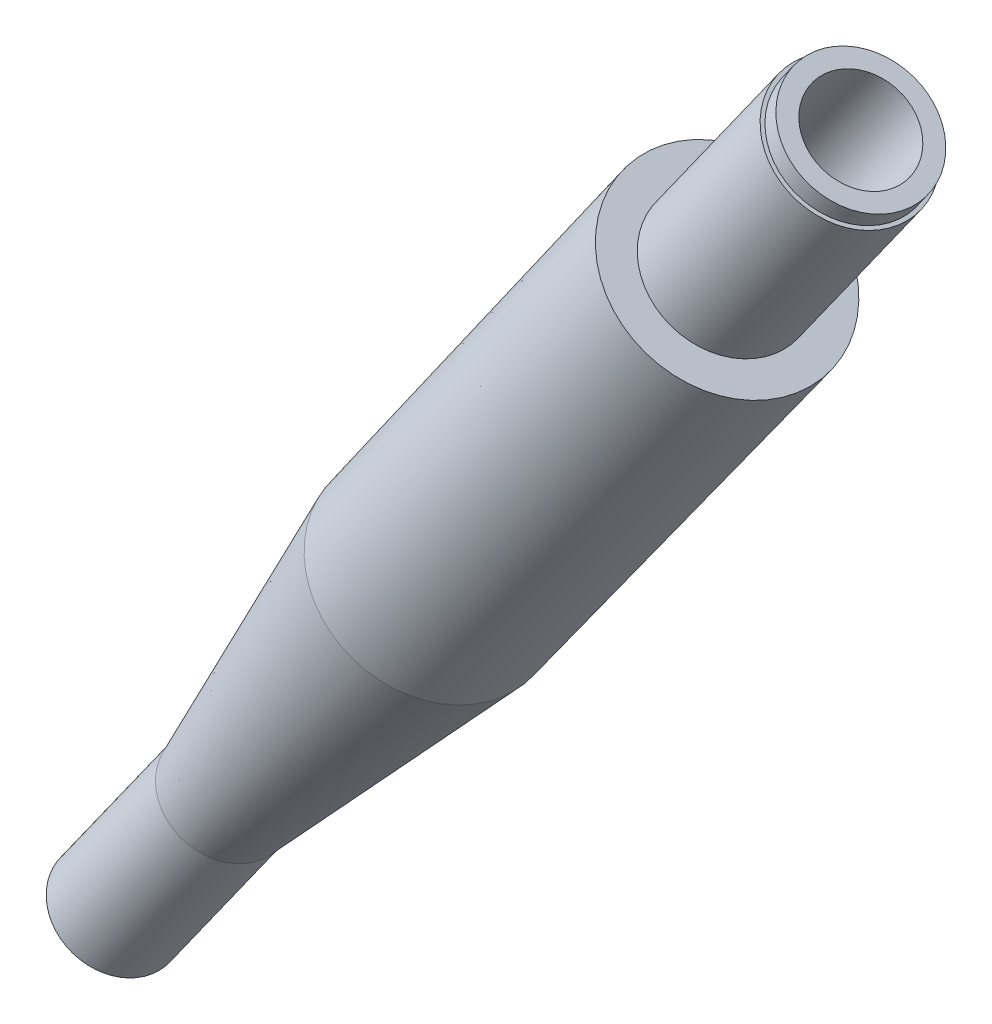
ISO-10303-21;
HEADER;
FILE_DESCRIPTION(('STEP AP214'),'2;1');
FILE_NAME('part.step','',(''),(''),'','','');
FILE_SCHEMA(('AUTOMOTIVE_DESIGN { 1 0 10303 214 1 1 1 1 }'));
ENDSEC;
DATA;
#1=APPLICATION_CONTEXT('core data for automotive mechanical design processes');
#2=APPLICATION_PROTOCOL_DEFINITION('international standard','automotive_design',2000,#1);
#3=PRODUCT_CONTEXT('',#1,'mechanical');
#4=PRODUCT('Part','Part','',(#3));
#5=PRODUCT_RELATED_PRODUCT_CATEGORY('part','',(#4));
#6=PRODUCT_DEFINITION_FORMATION('','',#4);
#7=PRODUCT_DEFINITION_CONTEXT('part definition',#1,'design');
#8=PRODUCT_DEFINITION('design','',#6,#7);
#9=PRODUCT_DEFINITION_SHAPE('','',#8);
#10=(LENGTH_UNIT() NAMED_UNIT(*) SI_UNIT(.MILLI.,.METRE.));
#11=(NAMED_UNIT(*) PLANE_ANGLE_UNIT() SI_UNIT($,.RADIAN.));
#12=(NAMED_UNIT(*) SI_UNIT($,.STERADIAN.) SOLID_ANGLE_UNIT());
#13=UNCERTAINTY_MEASURE_WITH_UNIT(LENGTH_MEASURE(1.E-05),#10,'distance_accuracy_value','');
#14=(GEOMETRIC_REPRESENTATION_CONTEXT(3) GLOBAL_UNCERTAINTY_ASSIGNED_CONTEXT((#13)) GLOBAL_UNIT_ASSIGNED_CONTEXT((#10,
#11,#12)) REPRESENTATION_CONTEXT('',''));
#15=CARTESIAN_POINT('',(0.,0.,0.));
#16=DIRECTION('',(0.,0.,1.));
#17=DIRECTION('',(1.,0.,0.));
#18=AXIS2_PLACEMENT_3D('',#15,#16,#17);
#19=CARTESIAN_POINT('',(18.2172899154048,-167.239352557248,-114.326374779815));
#20=DIRECTION('',(-0.579754018317099,-0.814791555089507,0.));
#21=DIRECTION('',(0.814791555089507,-0.579754018317099,0.));
#22=AXIS2_PLACEMENT_3D('',#19,#20,#21);
#23=CYLINDRICAL_SURFACE('',#22,3.69499999999996);
#24=CARTESIAN_POINT('',(50.6835149411624,-121.611025472235,-114.326374779815));
#25=DIRECTION('',(-0.579754018317099,-0.814791555089507,0.));
#26=DIRECTION('',(0.814791555089507,-0.579754018317099,0.));
#27=AXIS2_PLACEMENT_3D('',#24,#25,#26);
#28=CIRCLE('',#27,3.69499999999996);
#29=CARTESIAN_POINT('',(53.6941697372181,-123.753216569917,-114.326374779815));
#30=VERTEX_POINT('',#29);
#31=EDGE_CURVE('E65',#30,#30,#28,.T.);
#32=ORIENTED_EDGE('',*,*,#31,.F.);
#33=EDGE_LOOP('',(#32));
#34=FACE_BOUND('',#33,.T.);
#35=CARTESIAN_POINT('',(57.1999501070466,-112.452768393029,-114.326374779815));
#36=DIRECTION('',(0.579754018317099,0.814791555089507,0.));
#37=DIRECTION('',(-0.814791555089507,0.579754018317099,0.));
#38=AXIS2_PLACEMENT_3D('',#35,#36,#37);
#39=CIRCLE('',#38,3.69499999999996);
#40=CARTESIAN_POINT('',(54.1892953109909,-110.310577295348,-114.326374779815));
#41=VERTEX_POINT('',#40);
#42=EDGE_CURVE('E49',#41,#41,#39,.T.);
#43=ORIENTED_EDGE('',*,*,#42,.F.);
#44=EDGE_LOOP('',(#43));
#45=FACE_BOUND('',#44,.T.);
#46=ADVANCED_FACE('F45',(#34,#45),#23,.T.);
#47=CARTESIAN_POINT('',(18.2172899154048,-167.239352557248,-114.326374779815));
#48=DIRECTION('',(0.579754018317099,0.814791555089507,0.));
#49=DIRECTION('',(-0.814791555089507,0.579754018317099,0.));
#50=AXIS2_PLACEMENT_3D('',#47,#48,#49);
#51=PLANE('',#50);
#52=CARTESIAN_POINT('',(18.2172899154048,-167.239352557248,-114.326374779815));
#53=DIRECTION('',(-0.579754018317099,-0.814791555089507,0.));
#54=DIRECTION('',(0.814791555089507,-0.579754018317099,0.));
#55=AXIS2_PLACEMENT_3D('',#52,#53,#54);
#56=CIRCLE('',#55,2.84);
#57=CARTESIAN_POINT('',(20.531297931859,-168.885853969268,-114.326374779815));
#58=VERTEX_POINT('',#57);
#59=EDGE_CURVE('E13',#58,#58,#56,.T.);
#60=ORIENTED_EDGE('',*,*,#59,.T.);
#61=EDGE_LOOP('',(#60));
#62=FACE_BOUND('',#61,.T.);
#63=ADVANCED_FACE('F93',(#62),#51,.F.);
#64=CARTESIAN_POINT('',(18.2172899154048,-167.239352557248,-114.326374779815));
#65=DIRECTION('',(-0.579754018317099,-0.814791555089507,0.));
#66=DIRECTION('',(0.814791555089507,-0.579754018317099,0.));
#67=AXIS2_PLACEMENT_3D('',#64,#65,#66);
#68=CYLINDRICAL_SURFACE('',#67,2.83999999999999);
#69=ORIENTED_EDGE('',*,*,#59,.F.);
#70=EDGE_LOOP('',(#69));
#71=FACE_BOUND('',#70,.T.);
#72=CARTESIAN_POINT('',(24.0148300985758,-159.091437006353,-114.326374779815));
#73=DIRECTION('',(-0.579754018317099,-0.814791555089507,0.));
#74=DIRECTION('',(0.814791555089507,-0.579754018317099,0.));
#75=AXIS2_PLACEMENT_3D('',#72,#73,#74);
#76=CIRCLE('',#75,2.84);
#77=CARTESIAN_POINT('',(26.32883811503,-160.737938418373,-114.326374779815));
#78=VERTEX_POINT('',#77);
#79=EDGE_CURVE('E53',#78,#78,#76,.T.);
#80=ORIENTED_EDGE('',*,*,#79,.T.);
#81=EDGE_LOOP('',(#80));
#82=FACE_BOUND('',#81,.T.);
#83=ADVANCED_FACE('F99',(#71,#82),#68,.T.);
#84=CARTESIAN_POINT('',(35.0301564466007,-143.610397459652,-114.326374779815));
#85=DIRECTION('',(0.579754018317099,0.814791555089507,0.));
#86=DIRECTION('',(-0.814791555089507,0.579754018317099,0.));
#87=AXIS2_PLACEMENT_3D('',#84,#85,#86);
#88=CONICAL_SURFACE('',#87,5.26500000000001,0.126945242922444);
#89=ORIENTED_EDGE('',*,*,#79,.F.);
#90=EDGE_LOOP('',(#89));
#91=FACE_BOUND('',#90,.T.);
#92=CARTESIAN_POINT('',(35.0301564466007,-143.610397459652,-114.326374779815));
#93=DIRECTION('',(-0.579754018317099,-0.814791555089507,0.));
#94=DIRECTION('',(0.814791555089507,-0.579754018317099,0.));
#95=AXIS2_PLACEMENT_3D('',#92,#93,#94);
#96=CIRCLE('',#95,5.265);
#97=CARTESIAN_POINT('',(39.3200339841469,-146.662802366091,-114.326374779815));
#98=VERTEX_POINT('',#97);
#99=EDGE_CURVE('E57',#98,#98,#96,.T.);
#100=ORIENTED_EDGE('',*,*,#99,.T.);
#101=EDGE_LOOP('',(#100));
#102=FACE_BOUND('',#101,.T.);
#103=ADVANCED_FACE('F112',(#91,#102),#88,.T.);
#104=CARTESIAN_POINT('',(50.6835149411624,-121.611025472235,-114.326374779815));
#105=DIRECTION('',(0.579754018317099,0.814791555089507,0.));
#106=DIRECTION('',(-0.814791555089507,0.579754018317099,0.));
#107=AXIS2_PLACEMENT_3D('',#104,#105,#106);
#108=CONICAL_SURFACE('',#107,5.41999999999995,0.00574067767783551);
#109=ORIENTED_EDGE('',*,*,#99,.F.);
#110=EDGE_LOOP('',(#109));
#111=FACE_BOUND('',#110,.T.);
#112=CARTESIAN_POINT('',(50.6835149411624,-121.611025472235,-114.326374779815));
#113=DIRECTION('',(-0.579754018317099,-0.814791555089507,0.));
#114=DIRECTION('',(0.814791555089507,-0.579754018317099,0.));
#115=AXIS2_PLACEMENT_3D('',#112,#113,#114);
#116=CIRCLE('',#115,5.41999999999995);
#117=CARTESIAN_POINT('',(55.0996851697474,-124.753292251514,-114.326374779815));
#118=VERTEX_POINT('',#117);
#119=EDGE_CURVE('E62',#118,#118,#116,.T.);
#120=ORIENTED_EDGE('',*,*,#119,.T.);
#121=EDGE_LOOP('',(#120));
#122=FACE_BOUND('',#121,.T.);
#123=ADVANCED_FACE('F108',(#111,#122),#108,.T.);
#124=CARTESIAN_POINT('',(53.6941697372181,-123.753216569917,-114.326374779815));
#125=DIRECTION('',(-0.579754018317099,-0.814791555089507,0.));
#126=DIRECTION('',(0.814791555089507,-0.579754018317099,0.));
#127=AXIS2_PLACEMENT_3D('',#124,#125,#126);
#128=PLANE('',#127);
#129=ORIENTED_EDGE('',*,*,#119,.F.);
#130=EDGE_LOOP('',(#129));
#131=FACE_BOUND('',#130,.T.);
#132=ORIENTED_EDGE('',*,*,#31,.T.);
#133=EDGE_LOOP('',(#132));
#134=FACE_BOUND('',#133,.T.);
#135=ADVANCED_FACE('F105',(#131,#134),#128,.F.);
#136=CARTESIAN_POINT('',(57.4715464460257,-112.646019130472,-114.326374779815));
#137=DIRECTION('',(0.579754018317099,0.814791555089507,0.));
#138=DIRECTION('',(-0.814791555089507,0.579754018317099,0.));
#139=AXIS2_PLACEMENT_3D('',#136,#137,#138);
#140=PLANE('',#139);
#141=CARTESIAN_POINT('',(57.1999501070466,-112.452768393029,-114.326374779815));
#142=DIRECTION('',(0.579754018317099,0.814791555089507,0.));
#143=DIRECTION('',(-0.814791555089507,0.579754018317099,0.));
#144=AXIS2_PLACEMENT_3D('',#141,#142,#143);
#145=CIRCLE('',#144,3.49500000000001);
#146=CARTESIAN_POINT('',(54.3522536220087,-110.426528099011,-114.326374779815));
#147=VERTEX_POINT('',#146);
#148=EDGE_CURVE('E83',#147,#147,#145,.T.);
#149=ORIENTED_EDGE('',*,*,#148,.F.);
#150=EDGE_LOOP('',(#149));
#151=FACE_BOUND('',#150,.T.);
#152=ORIENTED_EDGE('',*,*,#42,.T.);
#153=EDGE_LOOP('',(#152));
#154=FACE_BOUND('',#153,.T.);
#155=ADVANCED_FACE('F90',(#151,#154),#140,.T.);
#156=CARTESIAN_POINT('',(57.1999501070466,-112.452768393029,-114.326374779815));
#157=DIRECTION('',(0.579754018317099,0.814791555089507,0.));
#158=DIRECTION('',(-0.814791555089507,0.579754018317099,0.));
#159=AXIS2_PLACEMENT_3D('',#156,#157,#158);
#160=CYLINDRICAL_SURFACE('',#159,3.49500000000001);
#161=ORIENTED_EDGE('',*,*,#148,.T.);
#162=EDGE_LOOP('',(#161));
#163=FACE_BOUND('',#162,.T.);
#164=CARTESIAN_POINT('',(57.7797041253637,-111.63797683794,-114.326374779815));
#165=DIRECTION('',(0.579754018317099,0.814791555089507,0.));
#166=DIRECTION('',(-0.814791555089507,0.579754018317099,0.));
#167=AXIS2_PLACEMENT_3D('',#164,#165,#166);
#168=CIRCLE('',#167,3.49500000000001);
#169=CARTESIAN_POINT('',(54.9320076403258,-109.611736543921,-114.326374779815));
#170=VERTEX_POINT('',#169);
#171=EDGE_CURVE('E80',#170,#170,#168,.T.);
#172=ORIENTED_EDGE('',*,*,#171,.F.);
#173=EDGE_LOOP('',(#172));
#174=FACE_BOUND('',#173,.T.);
#175=ADVANCED_FACE('F149',(#163,#174),#160,.T.);
#176=CARTESIAN_POINT('',(55.4606880520953,-114.897143058298,-114.326374779815));
#177=DIRECTION('',(-0.579754018317099,-0.814791555089507,0.));
#178=DIRECTION('',(0.814791555089507,-0.579754018317099,0.));
#179=AXIS2_PLACEMENT_3D('',#176,#177,#178);
#180=PLANE('',#179);
#181=CARTESIAN_POINT('',(55.4606880520953,-114.897143058298,-114.326374779815));
#182=DIRECTION('',(-0.579754018317099,-0.814791555089507,0.));
#183=DIRECTION('',(0.814791555089507,-0.579754018317099,0.));
#184=AXIS2_PLACEMENT_3D('',#181,#182,#183);
#185=CIRCLE('',#184,0.361130967016565);
#186=CARTESIAN_POINT('',(55.7549345143017,-115.106510187564,-114.326374779815));
#187=VERTEX_POINT('',#186);
#188=EDGE_CURVE('E77',#187,#187,#185,.T.);
#189=ORIENTED_EDGE('',*,*,#188,.F.);
#190=EDGE_LOOP('',(#189));
#191=FACE_BOUND('',#190,.T.);
#192=ADVANCED_FACE('F47',(#191),#180,.F.);
#193=CARTESIAN_POINT('',(18.2172899154048,-167.239352557248,-114.326374779815));
#194=DIRECTION('',(-0.579754018317099,-0.814791555089507,0.));
#195=DIRECTION('',(0.814791555089507,-0.579754018317099,0.));
#196=AXIS2_PLACEMENT_3D('',#193,#194,#195);
#197=CYLINDRICAL_SURFACE('',#196,0.361130967016571);
#198=CARTESIAN_POINT('',(50.6835149411624,-121.611025472235,-114.326374779815));
#199=DIRECTION('',(-0.579754018317099,-0.814791555089507,0.));
#200=DIRECTION('',(0.814791555089507,-0.579754018317099,0.));
#201=AXIS2_PLACEMENT_3D('',#198,#199,#200);
#202=CIRCLE('',#201,0.361130967016579);
#203=CARTESIAN_POINT('',(50.9777614033688,-121.820392601502,-114.326374779815));
#204=VERTEX_POINT('',#203);
#205=EDGE_CURVE('E74',#204,#204,#202,.T.);
#206=ORIENTED_EDGE('',*,*,#205,.F.);
#207=EDGE_LOOP('',(#206));
#208=FACE_BOUND('',#207,.T.);
#209=ORIENTED_EDGE('',*,*,#188,.T.);
#210=EDGE_LOOP('',(#209));
#211=FACE_BOUND('',#210,.T.);
#212=ADVANCED_FACE('F164',(#208,#211),#197,.T.);
#213=CARTESIAN_POINT('',(50.9777614033688,-121.820392601502,-114.326374779815));
#214=DIRECTION('',(-0.579754018317099,-0.814791555089507,0.));
#215=DIRECTION('',(0.814791555089507,-0.579754018317099,0.));
#216=AXIS2_PLACEMENT_3D('',#213,#214,#215);
#217=PLANE('',#216);
#218=CARTESIAN_POINT('',(50.6835149411624,-121.611025472235,-114.326374779815));
#219=DIRECTION('',(-0.579754018317099,-0.814791555089507,0.));
#220=DIRECTION('',(0.814791555089507,-0.579754018317099,0.));
#221=AXIS2_PLACEMENT_3D('',#218,#219,#220);
#222=CIRCLE('',#221,2.54999999999997);
#223=CARTESIAN_POINT('',(52.7612334066406,-123.089398218944,-114.326374779815));
#224=VERTEX_POINT('',#223);
#225=EDGE_CURVE('E71',#224,#224,#222,.T.);
#226=ORIENTED_EDGE('',*,*,#225,.F.);
#227=EDGE_LOOP('',(#226));
#228=FACE_BOUND('',#227,.T.);
#229=ORIENTED_EDGE('',*,*,#205,.T.);
#230=EDGE_LOOP('',(#229));
#231=FACE_BOUND('',#230,.T.);
#232=ADVANCED_FACE('F171',(#228,#231),#217,.F.);
#233=CARTESIAN_POINT('',(18.2172899154048,-167.239352557248,-114.326374779815));
#234=DIRECTION('',(-0.579754018317099,-0.814791555089507,0.));
#235=DIRECTION('',(0.814791555089507,-0.579754018317099,0.));
#236=AXIS2_PLACEMENT_3D('',#233,#234,#235);
#237=CYLINDRICAL_SURFACE('',#236,2.54999999999996);
#238=CARTESIAN_POINT('',(57.7797041253637,-111.63797683794,-114.326374779815));
#239=DIRECTION('',(-0.579754018317099,-0.814791555089507,0.));
#240=DIRECTION('',(0.814791555089507,-0.579754018317099,0.));
#241=AXIS2_PLACEMENT_3D('',#238,#239,#240);
#242=CIRCLE('',#241,2.54999999999995);
#243=CARTESIAN_POINT('',(59.8574225908419,-113.116349584648,-114.326374779815));
#244=VERTEX_POINT('',#243);
#245=EDGE_CURVE('E68',#244,#244,#242,.T.);
#246=ORIENTED_EDGE('',*,*,#245,.F.);
#247=EDGE_LOOP('',(#246));
#248=FACE_BOUND('',#247,.T.);
#249=ORIENTED_EDGE('',*,*,#225,.T.);
#250=EDGE_LOOP('',(#249));
#251=FACE_BOUND('',#250,.T.);
#252=ADVANCED_FACE('F179',(#248,#251),#237,.F.);
#253=CARTESIAN_POINT('',(59.8574225908419,-113.116349584648,-114.326374779815));
#254=DIRECTION('',(-0.579754018317099,-0.814791555089507,0.));
#255=DIRECTION('',(0.814791555089507,-0.579754018317099,0.));
#256=AXIS2_PLACEMENT_3D('',#253,#254,#255);
#257=PLANE('',#256);
#258=ORIENTED_EDGE('',*,*,#245,.T.);
#259=EDGE_LOOP('',(#258));
#260=FACE_BOUND('',#259,.T.);
#261=ORIENTED_EDGE('',*,*,#171,.T.);
#262=EDGE_LOOP('',(#261));
#263=FACE_BOUND('',#262,.T.);
#264=ADVANCED_FACE('F103',(#260,#263),#257,.F.);
#265=CLOSED_SHELL('',(#46,#63,#83,#103,#123,#135,#155,#175,#192,#212,#232,#252,#264));
#266=MANIFOLD_SOLID_BREP('B2',#265);
#267=ADVANCED_BREP_SHAPE_REPRESENTATION('',(#18,#266),#14);
#268=SHAPE_DEFINITION_REPRESENTATION(#9,#267);
ENDSEC;
END-ISO-10303-21;
